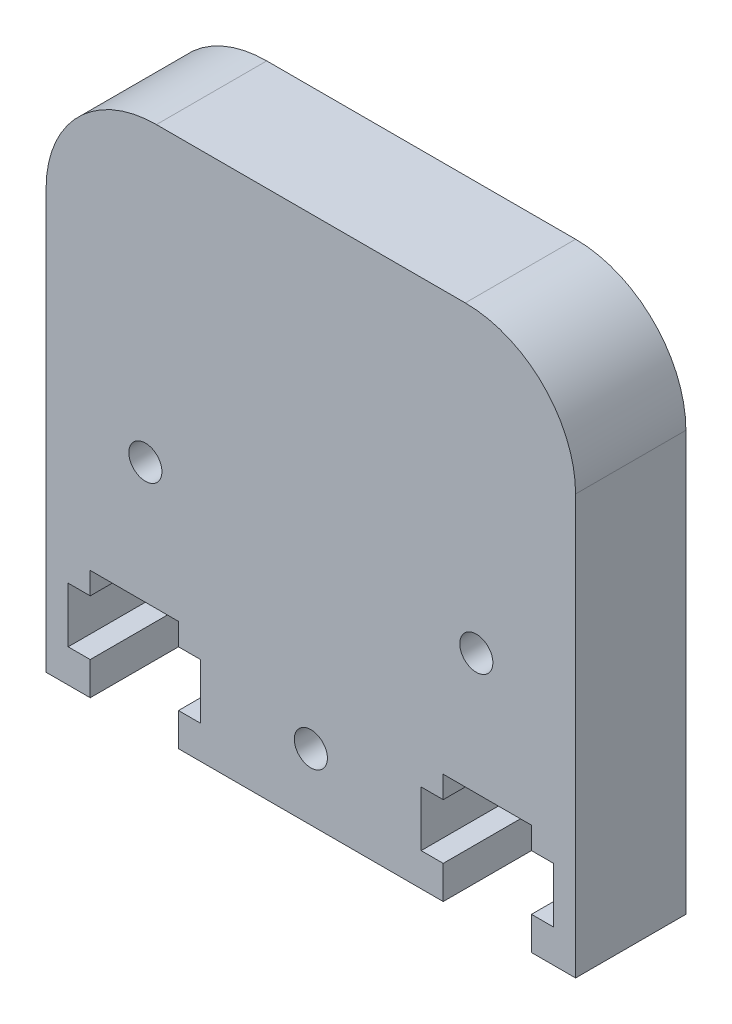
ISO-10303-21;
HEADER;
FILE_DESCRIPTION(('STEP AP214'),'2;1');
FILE_NAME('part.step','',(''),(''),'','','');
FILE_SCHEMA(('AUTOMOTIVE_DESIGN { 1 0 10303 214 1 1 1 1 }'));
ENDSEC;
DATA;
#1=APPLICATION_CONTEXT('core data for automotive mechanical design processes');
#2=APPLICATION_PROTOCOL_DEFINITION('international standard','automotive_design',2000,#1);
#3=PRODUCT_CONTEXT('',#1,'mechanical');
#4=PRODUCT('Part','Part','',(#3));
#5=PRODUCT_RELATED_PRODUCT_CATEGORY('part','',(#4));
#6=PRODUCT_DEFINITION_FORMATION('','',#4);
#7=PRODUCT_DEFINITION_CONTEXT('part definition',#1,'design');
#8=PRODUCT_DEFINITION('design','',#6,#7);
#9=PRODUCT_DEFINITION_SHAPE('','',#8);
#10=(LENGTH_UNIT() NAMED_UNIT(*) SI_UNIT(.MILLI.,.METRE.));
#11=(NAMED_UNIT(*) PLANE_ANGLE_UNIT() SI_UNIT($,.RADIAN.));
#12=(NAMED_UNIT(*) SI_UNIT($,.STERADIAN.) SOLID_ANGLE_UNIT());
#13=UNCERTAINTY_MEASURE_WITH_UNIT(LENGTH_MEASURE(1.E-05),#10,'distance_accuracy_value','');
#14=(GEOMETRIC_REPRESENTATION_CONTEXT(3) GLOBAL_UNCERTAINTY_ASSIGNED_CONTEXT((#13)) GLOBAL_UNIT_ASSIGNED_CONTEXT((#10,
#11,#12)) REPRESENTATION_CONTEXT('',''));
#15=CARTESIAN_POINT('',(0.,0.,0.));
#16=DIRECTION('',(0.,0.,1.));
#17=DIRECTION('',(1.,0.,0.));
#18=AXIS2_PLACEMENT_3D('',#15,#16,#17);
#19=CARTESIAN_POINT('',(0.,0.,5.));
#20=DIRECTION('',(0.,0.,1.));
#21=DIRECTION('',(1.,0.,0.));
#22=AXIS2_PLACEMENT_3D('',#19,#20,#21);
#23=PLANE('',#22);
#24=CARTESIAN_POINT('',(-7.5,-1.5,5.));
#25=DIRECTION('',(0.,0.,1.));
#26=DIRECTION('',(1.,0.,0.));
#27=AXIS2_PLACEMENT_3D('',#24,#25,#26);
#28=CIRCLE('',#27,0.750000000000001);
#29=CARTESIAN_POINT('',(-6.75,-1.5,5.));
#30=VERTEX_POINT('',#29);
#31=EDGE_CURVE('E415',#30,#30,#28,.T.);
#32=ORIENTED_EDGE('',*,*,#31,.F.);
#33=EDGE_LOOP('',(#32));
#34=FACE_BOUND('',#33,.T.);
#35=CARTESIAN_POINT('',(0.,-9.00000000000001,5.));
#36=DIRECTION('',(0.,0.,1.));
#37=DIRECTION('',(1.,0.,0.));
#38=AXIS2_PLACEMENT_3D('',#35,#36,#37);
#39=CIRCLE('',#38,0.750000000000001);
#40=CARTESIAN_POINT('',(0.750000000000004,-9.00000000000001,5.));
#41=VERTEX_POINT('',#40);
#42=EDGE_CURVE('E421',#41,#41,#39,.T.);
#43=ORIENTED_EDGE('',*,*,#42,.F.);
#44=EDGE_LOOP('',(#43));
#45=FACE_BOUND('',#44,.T.);
#46=CARTESIAN_POINT('',(7.5,-1.5,5.));
#47=DIRECTION('',(0.,0.,1.));
#48=DIRECTION('',(1.,0.,0.));
#49=AXIS2_PLACEMENT_3D('',#46,#47,#48);
#50=CIRCLE('',#49,0.750000000000038);
#51=CARTESIAN_POINT('',(8.25000000000004,-1.5,5.));
#52=VERTEX_POINT('',#51);
#53=EDGE_CURVE('E409',#52,#52,#50,.T.);
#54=ORIENTED_EDGE('',*,*,#53,.F.);
#55=EDGE_LOOP('',(#54));
#56=FACE_BOUND('',#55,.T.);
#57=DIRECTION('',(1.,0.,0.));
#58=VECTOR('',#57,1.);
#59=CARTESIAN_POINT('',(-12.,-12.,5.));
#60=LINE('',#59,#58);
#61=CARTESIAN_POINT('',(-6.,-12.,5.));
#62=VERTEX_POINT('',#61);
#63=CARTESIAN_POINT('',(6.,-12.,5.));
#64=VERTEX_POINT('',#63);
#65=EDGE_CURVE('E441',#62,#64,#60,.T.);
#66=ORIENTED_EDGE('',*,*,#65,.T.);
#67=DIRECTION('',(0.,1.,0.));
#68=VECTOR('',#67,1.);
#69=CARTESIAN_POINT('',(6.,-10.5,5.));
#70=LINE('',#69,#68);
#71=CARTESIAN_POINT('',(6.,-10.5,5.));
#72=VERTEX_POINT('',#71);
#73=EDGE_CURVE('E250',#64,#72,#70,.T.);
#74=ORIENTED_EDGE('',*,*,#73,.T.);
#75=DIRECTION('',(-1.,0.,0.));
#76=VECTOR('',#75,1.);
#77=CARTESIAN_POINT('',(5.,-10.5,5.));
#78=LINE('',#77,#76);
#79=CARTESIAN_POINT('',(5.,-10.5,5.));
#80=VERTEX_POINT('',#79);
#81=EDGE_CURVE('E253',#72,#80,#78,.T.);
#82=ORIENTED_EDGE('',*,*,#81,.T.);
#83=DIRECTION('',(0.,1.,0.));
#84=VECTOR('',#83,1.);
#85=CARTESIAN_POINT('',(5.,-8.,5.));
#86=LINE('',#85,#84);
#87=CARTESIAN_POINT('',(5.,-8.,5.));
#88=VERTEX_POINT('',#87);
#89=EDGE_CURVE('E294',#80,#88,#86,.T.);
#90=ORIENTED_EDGE('',*,*,#89,.T.);
#91=DIRECTION('',(1.,0.,0.));
#92=VECTOR('',#91,1.);
#93=CARTESIAN_POINT('',(6.,-8.,5.));
#94=LINE('',#93,#92);
#95=CARTESIAN_POINT('',(6.,-8.,5.));
#96=VERTEX_POINT('',#95);
#97=EDGE_CURVE('E291',#88,#96,#94,.T.);
#98=ORIENTED_EDGE('',*,*,#97,.T.);
#99=DIRECTION('',(0.,1.,0.));
#100=VECTOR('',#99,1.);
#101=CARTESIAN_POINT('',(6.,-7.,5.));
#102=LINE('',#101,#100);
#103=CARTESIAN_POINT('',(6.,-7.,5.));
#104=VERTEX_POINT('',#103);
#105=EDGE_CURVE('E288',#96,#104,#102,.T.);
#106=ORIENTED_EDGE('',*,*,#105,.T.);
#107=DIRECTION('',(1.,0.,0.));
#108=VECTOR('',#107,1.);
#109=CARTESIAN_POINT('',(10.,-7.,5.));
#110=LINE('',#109,#108);
#111=CARTESIAN_POINT('',(10.,-7.,5.));
#112=VERTEX_POINT('',#111);
#113=EDGE_CURVE('E285',#104,#112,#110,.T.);
#114=ORIENTED_EDGE('',*,*,#113,.T.);
#115=DIRECTION('',(0.,-1.,0.));
#116=VECTOR('',#115,1.);
#117=CARTESIAN_POINT('',(10.,-8.,5.));
#118=LINE('',#117,#116);
#119=CARTESIAN_POINT('',(10.,-8.,5.));
#120=VERTEX_POINT('',#119);
#121=EDGE_CURVE('E282',#112,#120,#118,.T.);
#122=ORIENTED_EDGE('',*,*,#121,.T.);
#123=DIRECTION('',(1.,0.,0.));
#124=VECTOR('',#123,1.);
#125=CARTESIAN_POINT('',(11.,-8.,5.));
#126=LINE('',#125,#124);
#127=CARTESIAN_POINT('',(11.,-8.,5.));
#128=VERTEX_POINT('',#127);
#129=EDGE_CURVE('E279',#120,#128,#126,.T.);
#130=ORIENTED_EDGE('',*,*,#129,.T.);
#131=DIRECTION('',(0.,-1.,0.));
#132=VECTOR('',#131,1.);
#133=CARTESIAN_POINT('',(11.,-10.5,5.));
#134=LINE('',#133,#132);
#135=CARTESIAN_POINT('',(11.,-10.5,5.));
#136=VERTEX_POINT('',#135);
#137=EDGE_CURVE('E276',#128,#136,#134,.T.);
#138=ORIENTED_EDGE('',*,*,#137,.T.);
#139=DIRECTION('',(-1.,0.,0.));
#140=VECTOR('',#139,1.);
#141=CARTESIAN_POINT('',(10.,-10.5,5.));
#142=LINE('',#141,#140);
#143=CARTESIAN_POINT('',(10.,-10.5,5.));
#144=VERTEX_POINT('',#143);
#145=EDGE_CURVE('E274',#136,#144,#142,.T.);
#146=ORIENTED_EDGE('',*,*,#145,.T.);
#147=DIRECTION('',(0.,-1.,0.));
#148=VECTOR('',#147,1.);
#149=CARTESIAN_POINT('',(10.,-12.,5.));
#150=LINE('',#149,#148);
#151=CARTESIAN_POINT('',(10.,-12.,5.));
#152=VERTEX_POINT('',#151);
#153=EDGE_CURVE('E241',#144,#152,#150,.T.);
#154=ORIENTED_EDGE('',*,*,#153,.T.);
#155=CARTESIAN_POINT('',(12.,-12.,5.));
#156=VERTEX_POINT('',#155);
#157=EDGE_CURVE('E436',#152,#156,#60,.T.);
#158=ORIENTED_EDGE('',*,*,#157,.T.);
#159=DIRECTION('',(0.,1.,0.));
#160=VECTOR('',#159,1.);
#161=CARTESIAN_POINT('',(12.,12.,5.));
#162=LINE('',#161,#160);
#163=CARTESIAN_POINT('',(12.,7.,5.));
#164=VERTEX_POINT('',#163);
#165=EDGE_CURVE('E427',#156,#164,#162,.T.);
#166=ORIENTED_EDGE('',*,*,#165,.T.);
#167=CARTESIAN_POINT('',(7.,7.,5.));
#168=DIRECTION('',(0.,0.,1.));
#169=DIRECTION('',(1.,0.,0.));
#170=AXIS2_PLACEMENT_3D('',#167,#168,#169);
#171=CIRCLE('',#170,5.);
#172=CARTESIAN_POINT('',(7.,12.,5.));
#173=VERTEX_POINT('',#172);
#174=EDGE_CURVE('E469',#164,#173,#171,.T.);
#175=ORIENTED_EDGE('',*,*,#174,.T.);
#176=DIRECTION('',(-1.,0.,0.));
#177=VECTOR('',#176,1.);
#178=CARTESIAN_POINT('',(-12.,12.,5.));
#179=LINE('',#178,#177);
#180=CARTESIAN_POINT('',(-7.,12.,5.));
#181=VERTEX_POINT('',#180);
#182=EDGE_CURVE('E430',#173,#181,#179,.T.);
#183=ORIENTED_EDGE('',*,*,#182,.T.);
#184=CARTESIAN_POINT('',(-7.,7.,5.));
#185=DIRECTION('',(0.,0.,1.));
#186=DIRECTION('',(1.,0.,0.));
#187=AXIS2_PLACEMENT_3D('',#184,#185,#186);
#188=CIRCLE('',#187,5.);
#189=CARTESIAN_POINT('',(-12.,7.,5.));
#190=VERTEX_POINT('',#189);
#191=EDGE_CURVE('E40',#181,#190,#188,.T.);
#192=ORIENTED_EDGE('',*,*,#191,.T.);
#193=DIRECTION('',(0.,-1.,0.));
#194=VECTOR('',#193,1.);
#195=CARTESIAN_POINT('',(-12.,12.,5.));
#196=LINE('',#195,#194);
#197=CARTESIAN_POINT('',(-12.,-12.,5.));
#198=VERTEX_POINT('',#197);
#199=EDGE_CURVE('E434',#190,#198,#196,.T.);
#200=ORIENTED_EDGE('',*,*,#199,.T.);
#201=CARTESIAN_POINT('',(-10.,-12.,5.));
#202=VERTEX_POINT('',#201);
#203=EDGE_CURVE('E437',#198,#202,#60,.T.);
#204=ORIENTED_EDGE('',*,*,#203,.T.);
#205=DIRECTION('',(0.,-1.,0.));
#206=VECTOR('',#205,1.);
#207=CARTESIAN_POINT('',(-10.,-12.,5.));
#208=LINE('',#207,#206);
#209=CARTESIAN_POINT('',(-10.,-10.5,5.));
#210=VERTEX_POINT('',#209);
#211=EDGE_CURVE('E323',#210,#202,#208,.T.);
#212=ORIENTED_EDGE('',*,*,#211,.F.);
#213=DIRECTION('',(1.,0.,0.));
#214=VECTOR('',#213,1.);
#215=CARTESIAN_POINT('',(-10.,-10.5,5.));
#216=LINE('',#215,#214);
#217=CARTESIAN_POINT('',(-11.,-10.5,5.));
#218=VERTEX_POINT('',#217);
#219=EDGE_CURVE('E380',#218,#210,#216,.T.);
#220=ORIENTED_EDGE('',*,*,#219,.F.);
#221=DIRECTION('',(0.,-1.,0.));
#222=VECTOR('',#221,1.);
#223=CARTESIAN_POINT('',(-11.,-10.5,5.));
#224=LINE('',#223,#222);
#225=CARTESIAN_POINT('',(-11.,-8.,5.));
#226=VERTEX_POINT('',#225);
#227=EDGE_CURVE('E377',#226,#218,#224,.T.);
#228=ORIENTED_EDGE('',*,*,#227,.F.);
#229=DIRECTION('',(-1.,0.,0.));
#230=VECTOR('',#229,1.);
#231=CARTESIAN_POINT('',(-11.,-8.,5.));
#232=LINE('',#231,#230);
#233=CARTESIAN_POINT('',(-10.,-8.,5.));
#234=VERTEX_POINT('',#233);
#235=EDGE_CURVE('E374',#234,#226,#232,.T.);
#236=ORIENTED_EDGE('',*,*,#235,.F.);
#237=DIRECTION('',(0.,-1.,0.));
#238=VECTOR('',#237,1.);
#239=CARTESIAN_POINT('',(-10.,-8.,5.));
#240=LINE('',#239,#238);
#241=CARTESIAN_POINT('',(-10.,-7.,5.));
#242=VERTEX_POINT('',#241);
#243=EDGE_CURVE('E371',#242,#234,#240,.T.);
#244=ORIENTED_EDGE('',*,*,#243,.F.);
#245=DIRECTION('',(-1.,0.,0.));
#246=VECTOR('',#245,1.);
#247=CARTESIAN_POINT('',(-10.,-7.,5.));
#248=LINE('',#247,#246);
#249=CARTESIAN_POINT('',(-6.,-7.,5.));
#250=VERTEX_POINT('',#249);
#251=EDGE_CURVE('E368',#250,#242,#248,.T.);
#252=ORIENTED_EDGE('',*,*,#251,.F.);
#253=DIRECTION('',(0.,1.,0.));
#254=VECTOR('',#253,1.);
#255=CARTESIAN_POINT('',(-6.,-7.,5.));
#256=LINE('',#255,#254);
#257=CARTESIAN_POINT('',(-6.,-8.,5.));
#258=VERTEX_POINT('',#257);
#259=EDGE_CURVE('E365',#258,#250,#256,.T.);
#260=ORIENTED_EDGE('',*,*,#259,.F.);
#261=DIRECTION('',(-1.,0.,0.));
#262=VECTOR('',#261,1.);
#263=CARTESIAN_POINT('',(-6.,-8.,5.));
#264=LINE('',#263,#262);
#265=CARTESIAN_POINT('',(-5.,-8.,5.));
#266=VERTEX_POINT('',#265);
#267=EDGE_CURVE('E362',#266,#258,#264,.T.);
#268=ORIENTED_EDGE('',*,*,#267,.F.);
#269=DIRECTION('',(0.,1.,0.));
#270=VECTOR('',#269,1.);
#271=CARTESIAN_POINT('',(-5.,-8.,5.));
#272=LINE('',#271,#270);
#273=CARTESIAN_POINT('',(-5.,-10.5,5.));
#274=VERTEX_POINT('',#273);
#275=EDGE_CURVE('E359',#274,#266,#272,.T.);
#276=ORIENTED_EDGE('',*,*,#275,.F.);
#277=DIRECTION('',(1.,0.,0.));
#278=VECTOR('',#277,1.);
#279=CARTESIAN_POINT('',(-5.,-10.5,5.));
#280=LINE('',#279,#278);
#281=CARTESIAN_POINT('',(-6.,-10.5,5.));
#282=VERTEX_POINT('',#281);
#283=EDGE_CURVE('E356',#282,#274,#280,.T.);
#284=ORIENTED_EDGE('',*,*,#283,.F.);
#285=DIRECTION('',(0.,1.,0.));
#286=VECTOR('',#285,1.);
#287=CARTESIAN_POINT('',(-6.,-10.5,5.));
#288=LINE('',#287,#286);
#289=EDGE_CURVE('E302',#62,#282,#288,.T.);
#290=ORIENTED_EDGE('',*,*,#289,.F.);
#291=EDGE_LOOP('',(#66,#74,#82,#90,#98,#106,#114,#122,#130,#138,#146,#154,#158,#166,#175,#183,
#192,#200,#204,#212,#220,#228,#236,#244,#252,#260,#268,#276,#284,#290));
#292=FACE_BOUND('',#291,.T.);
#293=ADVANCED_FACE('F32',(#34,#45,#56,#292),#23,.T.);
#294=CARTESIAN_POINT('',(0.,0.,0.));
#295=DIRECTION('',(0.,0.,1.));
#296=DIRECTION('',(1.,0.,0.));
#297=AXIS2_PLACEMENT_3D('',#294,#295,#296);
#298=PLANE('',#297);
#299=CARTESIAN_POINT('',(7.5,-1.5,0.));
#300=DIRECTION('',(0.,0.,1.));
#301=DIRECTION('',(1.,0.,0.));
#302=AXIS2_PLACEMENT_3D('',#299,#300,#301);
#303=CIRCLE('',#302,0.750000000000038);
#304=CARTESIAN_POINT('',(8.25000000000004,-1.5,0.));
#305=VERTEX_POINT('',#304);
#306=EDGE_CURVE('E387',#305,#305,#303,.T.);
#307=ORIENTED_EDGE('',*,*,#306,.T.);
#308=EDGE_LOOP('',(#307));
#309=FACE_BOUND('',#308,.T.);
#310=CARTESIAN_POINT('',(-7.5,-1.5,0.));
#311=DIRECTION('',(0.,0.,1.));
#312=DIRECTION('',(1.,0.,0.));
#313=AXIS2_PLACEMENT_3D('',#310,#311,#312);
#314=CIRCLE('',#313,0.750000000000001);
#315=CARTESIAN_POINT('',(-6.75,-1.5,0.));
#316=VERTEX_POINT('',#315);
#317=EDGE_CURVE('E412',#316,#316,#314,.T.);
#318=ORIENTED_EDGE('',*,*,#317,.T.);
#319=EDGE_LOOP('',(#318));
#320=FACE_BOUND('',#319,.T.);
#321=CARTESIAN_POINT('',(0.,-9.00000000000001,0.));
#322=DIRECTION('',(0.,0.,1.));
#323=DIRECTION('',(1.,0.,0.));
#324=AXIS2_PLACEMENT_3D('',#321,#322,#323);
#325=CIRCLE('',#324,0.750000000000001);
#326=CARTESIAN_POINT('',(0.750000000000004,-9.00000000000001,0.));
#327=VERTEX_POINT('',#326);
#328=EDGE_CURVE('E418',#327,#327,#325,.T.);
#329=ORIENTED_EDGE('',*,*,#328,.T.);
#330=EDGE_LOOP('',(#329));
#331=FACE_BOUND('',#330,.T.);
#332=DIRECTION('',(0.,1.,0.));
#333=VECTOR('',#332,1.);
#334=CARTESIAN_POINT('',(6.,-10.5,0.));
#335=LINE('',#334,#333);
#336=CARTESIAN_POINT('',(6.,-12.,0.));
#337=VERTEX_POINT('',#336);
#338=CARTESIAN_POINT('',(6.,-10.5,0.));
#339=VERTEX_POINT('',#338);
#340=EDGE_CURVE('E271',#337,#339,#335,.T.);
#341=ORIENTED_EDGE('',*,*,#340,.F.);
#342=DIRECTION('',(1.,0.,0.));
#343=VECTOR('',#342,1.);
#344=CARTESIAN_POINT('',(-12.,-12.,0.));
#345=LINE('',#344,#343);
#346=CARTESIAN_POINT('',(-6.,-12.,0.));
#347=VERTEX_POINT('',#346);
#348=EDGE_CURVE('E451',#347,#337,#345,.T.);
#349=ORIENTED_EDGE('',*,*,#348,.F.);
#350=DIRECTION('',(0.,1.,0.));
#351=VECTOR('',#350,1.);
#352=CARTESIAN_POINT('',(-6.,-10.5,0.));
#353=LINE('',#352,#351);
#354=CARTESIAN_POINT('',(-6.,-10.5,0.));
#355=VERTEX_POINT('',#354);
#356=EDGE_CURVE('E55',#347,#355,#353,.T.);
#357=ORIENTED_EDGE('',*,*,#356,.T.);
#358=DIRECTION('',(1.,0.,0.));
#359=VECTOR('',#358,1.);
#360=CARTESIAN_POINT('',(-5.,-10.5,0.));
#361=LINE('',#360,#359);
#362=CARTESIAN_POINT('',(-5.,-10.5,0.));
#363=VERTEX_POINT('',#362);
#364=EDGE_CURVE('E322',#355,#363,#361,.T.);
#365=ORIENTED_EDGE('',*,*,#364,.T.);
#366=DIRECTION('',(0.,1.,0.));
#367=VECTOR('',#366,1.);
#368=CARTESIAN_POINT('',(-5.,-8.,0.));
#369=LINE('',#368,#367);
#370=CARTESIAN_POINT('',(-5.,-8.,0.));
#371=VERTEX_POINT('',#370);
#372=EDGE_CURVE('E326',#363,#371,#369,.T.);
#373=ORIENTED_EDGE('',*,*,#372,.T.);
#374=DIRECTION('',(-1.,0.,0.));
#375=VECTOR('',#374,1.);
#376=CARTESIAN_POINT('',(-6.,-8.,0.));
#377=LINE('',#376,#375);
#378=CARTESIAN_POINT('',(-6.,-8.,0.));
#379=VERTEX_POINT('',#378);
#380=EDGE_CURVE('E329',#371,#379,#377,.T.);
#381=ORIENTED_EDGE('',*,*,#380,.T.);
#382=DIRECTION('',(0.,1.,0.));
#383=VECTOR('',#382,1.);
#384=CARTESIAN_POINT('',(-6.,-7.,0.));
#385=LINE('',#384,#383);
#386=CARTESIAN_POINT('',(-6.,-7.,0.));
#387=VERTEX_POINT('',#386);
#388=EDGE_CURVE('E332',#379,#387,#385,.T.);
#389=ORIENTED_EDGE('',*,*,#388,.T.);
#390=DIRECTION('',(-1.,0.,0.));
#391=VECTOR('',#390,1.);
#392=CARTESIAN_POINT('',(-10.,-7.,0.));
#393=LINE('',#392,#391);
#394=CARTESIAN_POINT('',(-10.,-7.,0.));
#395=VERTEX_POINT('',#394);
#396=EDGE_CURVE('E335',#387,#395,#393,.T.);
#397=ORIENTED_EDGE('',*,*,#396,.T.);
#398=DIRECTION('',(0.,-1.,0.));
#399=VECTOR('',#398,1.);
#400=CARTESIAN_POINT('',(-10.,-8.,0.));
#401=LINE('',#400,#399);
#402=CARTESIAN_POINT('',(-10.,-8.,0.));
#403=VERTEX_POINT('',#402);
#404=EDGE_CURVE('E338',#395,#403,#401,.T.);
#405=ORIENTED_EDGE('',*,*,#404,.T.);
#406=DIRECTION('',(-1.,0.,0.));
#407=VECTOR('',#406,1.);
#408=CARTESIAN_POINT('',(-11.,-8.,0.));
#409=LINE('',#408,#407);
#410=CARTESIAN_POINT('',(-11.,-8.,0.));
#411=VERTEX_POINT('',#410);
#412=EDGE_CURVE('E341',#403,#411,#409,.T.);
#413=ORIENTED_EDGE('',*,*,#412,.T.);
#414=DIRECTION('',(0.,-1.,0.));
#415=VECTOR('',#414,1.);
#416=CARTESIAN_POINT('',(-11.,-10.5,0.));
#417=LINE('',#416,#415);
#418=CARTESIAN_POINT('',(-11.,-10.5,0.));
#419=VERTEX_POINT('',#418);
#420=EDGE_CURVE('E344',#411,#419,#417,.T.);
#421=ORIENTED_EDGE('',*,*,#420,.T.);
#422=DIRECTION('',(1.,0.,0.));
#423=VECTOR('',#422,1.);
#424=CARTESIAN_POINT('',(-10.,-10.5,0.));
#425=LINE('',#424,#423);
#426=CARTESIAN_POINT('',(-10.,-10.5,0.));
#427=VERTEX_POINT('',#426);
#428=EDGE_CURVE('E347',#419,#427,#425,.T.);
#429=ORIENTED_EDGE('',*,*,#428,.T.);
#430=DIRECTION('',(0.,-1.,0.));
#431=VECTOR('',#430,1.);
#432=CARTESIAN_POINT('',(-10.,-12.,0.));
#433=LINE('',#432,#431);
#434=CARTESIAN_POINT('',(-10.,-12.,0.));
#435=VERTEX_POINT('',#434);
#436=EDGE_CURVE('E350',#427,#435,#433,.T.);
#437=ORIENTED_EDGE('',*,*,#436,.T.);
#438=CARTESIAN_POINT('',(-12.,-12.,0.));
#439=VERTEX_POINT('',#438);
#440=EDGE_CURVE('E431',#439,#435,#345,.T.);
#441=ORIENTED_EDGE('',*,*,#440,.F.);
#442=DIRECTION('',(0.,-1.,0.));
#443=VECTOR('',#442,1.);
#444=CARTESIAN_POINT('',(-12.,12.,0.));
#445=LINE('',#444,#443);
#446=CARTESIAN_POINT('',(-12.,7.,0.));
#447=VERTEX_POINT('',#446);
#448=EDGE_CURVE('E447',#447,#439,#445,.T.);
#449=ORIENTED_EDGE('',*,*,#448,.F.);
#450=CARTESIAN_POINT('',(-7.,7.,0.));
#451=DIRECTION('',(0.,0.,1.));
#452=DIRECTION('',(1.,0.,0.));
#453=AXIS2_PLACEMENT_3D('',#450,#451,#452);
#454=CIRCLE('',#453,5.);
#455=CARTESIAN_POINT('',(-7.,12.,0.));
#456=VERTEX_POINT('',#455);
#457=EDGE_CURVE('E462',#447,#456,#454,.F.);
#458=ORIENTED_EDGE('',*,*,#457,.T.);
#459=DIRECTION('',(-1.,0.,0.));
#460=VECTOR('',#459,1.);
#461=CARTESIAN_POINT('',(-12.,12.,0.));
#462=LINE('',#461,#460);
#463=CARTESIAN_POINT('',(7.,12.,0.));
#464=VERTEX_POINT('',#463);
#465=EDGE_CURVE('E444',#464,#456,#462,.T.);
#466=ORIENTED_EDGE('',*,*,#465,.F.);
#467=CARTESIAN_POINT('',(7.,7.,0.));
#468=DIRECTION('',(0.,0.,1.));
#469=DIRECTION('',(1.,0.,0.));
#470=AXIS2_PLACEMENT_3D('',#467,#468,#469);
#471=CIRCLE('',#470,5.);
#472=CARTESIAN_POINT('',(12.,7.,0.));
#473=VERTEX_POINT('',#472);
#474=EDGE_CURVE('E460',#464,#473,#471,.F.);
#475=ORIENTED_EDGE('',*,*,#474,.T.);
#476=DIRECTION('',(0.,1.,0.));
#477=VECTOR('',#476,1.);
#478=CARTESIAN_POINT('',(12.,12.,0.));
#479=LINE('',#478,#477);
#480=CARTESIAN_POINT('',(12.,-12.,0.));
#481=VERTEX_POINT('',#480);
#482=EDGE_CURVE('E424',#481,#473,#479,.T.);
#483=ORIENTED_EDGE('',*,*,#482,.F.);
#484=CARTESIAN_POINT('',(10.,-12.,0.));
#485=VERTEX_POINT('',#484);
#486=EDGE_CURVE('E249',#485,#481,#345,.T.);
#487=ORIENTED_EDGE('',*,*,#486,.F.);
#488=DIRECTION('',(0.,-1.,0.));
#489=VECTOR('',#488,1.);
#490=CARTESIAN_POINT('',(10.,-12.,0.));
#491=LINE('',#490,#489);
#492=CARTESIAN_POINT('',(10.,-10.5,0.));
#493=VERTEX_POINT('',#492);
#494=EDGE_CURVE('E47',#493,#485,#491,.T.);
#495=ORIENTED_EDGE('',*,*,#494,.F.);
#496=DIRECTION('',(-1.,0.,0.));
#497=VECTOR('',#496,1.);
#498=CARTESIAN_POINT('',(10.,-10.5,0.));
#499=LINE('',#498,#497);
#500=CARTESIAN_POINT('',(11.,-10.5,0.));
#501=VERTEX_POINT('',#500);
#502=EDGE_CURVE('E229',#501,#493,#499,.T.);
#503=ORIENTED_EDGE('',*,*,#502,.F.);
#504=DIRECTION('',(0.,-1.,0.));
#505=VECTOR('',#504,1.);
#506=CARTESIAN_POINT('',(11.,-10.5,0.));
#507=LINE('',#506,#505);
#508=CARTESIAN_POINT('',(11.,-8.,0.));
#509=VERTEX_POINT('',#508);
#510=EDGE_CURVE('E237',#509,#501,#507,.T.);
#511=ORIENTED_EDGE('',*,*,#510,.F.);
#512=DIRECTION('',(1.,0.,0.));
#513=VECTOR('',#512,1.);
#514=CARTESIAN_POINT('',(11.,-8.,0.));
#515=LINE('',#514,#513);
#516=CARTESIAN_POINT('',(10.,-8.,0.));
#517=VERTEX_POINT('',#516);
#518=EDGE_CURVE('E257',#517,#509,#515,.T.);
#519=ORIENTED_EDGE('',*,*,#518,.F.);
#520=DIRECTION('',(0.,-1.,0.));
#521=VECTOR('',#520,1.);
#522=CARTESIAN_POINT('',(10.,-8.,0.));
#523=LINE('',#522,#521);
#524=CARTESIAN_POINT('',(10.,-7.,0.));
#525=VERTEX_POINT('',#524);
#526=EDGE_CURVE('E259',#525,#517,#523,.T.);
#527=ORIENTED_EDGE('',*,*,#526,.F.);
#528=DIRECTION('',(1.,0.,0.));
#529=VECTOR('',#528,1.);
#530=CARTESIAN_POINT('',(10.,-7.,0.));
#531=LINE('',#530,#529);
#532=CARTESIAN_POINT('',(6.,-7.,0.));
#533=VERTEX_POINT('',#532);
#534=EDGE_CURVE('E261',#533,#525,#531,.T.);
#535=ORIENTED_EDGE('',*,*,#534,.F.);
#536=DIRECTION('',(0.,1.,0.));
#537=VECTOR('',#536,1.);
#538=CARTESIAN_POINT('',(6.,-7.,0.));
#539=LINE('',#538,#537);
#540=CARTESIAN_POINT('',(6.,-8.,0.));
#541=VERTEX_POINT('',#540);
#542=EDGE_CURVE('E263',#541,#533,#539,.T.);
#543=ORIENTED_EDGE('',*,*,#542,.F.);
#544=DIRECTION('',(1.,0.,0.));
#545=VECTOR('',#544,1.);
#546=CARTESIAN_POINT('',(6.,-8.,0.));
#547=LINE('',#546,#545);
#548=CARTESIAN_POINT('',(5.,-8.,0.));
#549=VERTEX_POINT('',#548);
#550=EDGE_CURVE('E265',#549,#541,#547,.T.);
#551=ORIENTED_EDGE('',*,*,#550,.F.);
#552=DIRECTION('',(0.,1.,0.));
#553=VECTOR('',#552,1.);
#554=CARTESIAN_POINT('',(5.,-8.,0.));
#555=LINE('',#554,#553);
#556=CARTESIAN_POINT('',(5.,-10.5,0.));
#557=VERTEX_POINT('',#556);
#558=EDGE_CURVE('E267',#557,#549,#555,.T.);
#559=ORIENTED_EDGE('',*,*,#558,.F.);
#560=DIRECTION('',(-1.,0.,0.));
#561=VECTOR('',#560,1.);
#562=CARTESIAN_POINT('',(5.,-10.5,0.));
#563=LINE('',#562,#561);
#564=EDGE_CURVE('E269',#339,#557,#563,.T.);
#565=ORIENTED_EDGE('',*,*,#564,.F.);
#566=EDGE_LOOP('',(#341,#349,#357,#365,#373,#381,#389,#397,#405,#413,#421,#429,#437,#441,#449,
#458,#466,#475,#483,#487,#495,#503,#511,#519,#527,#535,#543,#551,#559,#565));
#567=FACE_BOUND('',#566,.T.);
#568=ADVANCED_FACE('F247',(#309,#320,#331,#567),#298,.F.);
#569=CARTESIAN_POINT('',(-12.,-12.,5.));
#570=DIRECTION('',(0.,1.,0.));
#571=DIRECTION('',(-1.,0.,0.));
#572=AXIS2_PLACEMENT_3D('',#569,#570,#571);
#573=PLANE('',#572);
#574=DIRECTION('',(0.,0.,1.));
#575=VECTOR('',#574,1.);
#576=CARTESIAN_POINT('',(6.,-12.,0.));
#577=LINE('',#576,#575);
#578=EDGE_CURVE('E299',#337,#64,#577,.T.);
#579=ORIENTED_EDGE('',*,*,#578,.T.);
#580=ORIENTED_EDGE('',*,*,#65,.F.);
#581=DIRECTION('',(0.,0.,1.));
#582=VECTOR('',#581,1.);
#583=CARTESIAN_POINT('',(-6.,-12.,0.));
#584=LINE('',#583,#582);
#585=EDGE_CURVE('E353',#347,#62,#584,.T.);
#586=ORIENTED_EDGE('',*,*,#585,.F.);
#587=ORIENTED_EDGE('',*,*,#348,.T.);
#588=EDGE_LOOP('',(#579,#580,#586,#587));
#589=FACE_BOUND('',#588,.T.);
#590=ADVANCED_FACE('F502',(#589),#573,.F.);
#591=DIRECTION('',(0.,0.,1.));
#592=VECTOR('',#591,1.);
#593=CARTESIAN_POINT('',(10.,-12.,0.));
#594=LINE('',#593,#592);
#595=EDGE_CURVE('E243',#485,#152,#594,.T.);
#596=ORIENTED_EDGE('',*,*,#595,.F.);
#597=ORIENTED_EDGE('',*,*,#486,.T.);
#598=DIRECTION('',(0.,0.,-1.));
#599=VECTOR('',#598,1.);
#600=CARTESIAN_POINT('',(12.,-12.,5.));
#601=LINE('',#600,#599);
#602=EDGE_CURVE('E440',#156,#481,#601,.T.);
#603=ORIENTED_EDGE('',*,*,#602,.F.);
#604=ORIENTED_EDGE('',*,*,#157,.F.);
#605=EDGE_LOOP('',(#596,#597,#603,#604));
#606=FACE_BOUND('',#605,.T.);
#607=ADVANCED_FACE('F498',(#606),#573,.F.);
#608=ORIENTED_EDGE('',*,*,#440,.T.);
#609=DIRECTION('',(0.,0.,1.));
#610=VECTOR('',#609,1.);
#611=CARTESIAN_POINT('',(-10.,-12.,0.));
#612=LINE('',#611,#610);
#613=EDGE_CURVE('E384',#435,#202,#612,.T.);
#614=ORIENTED_EDGE('',*,*,#613,.T.);
#615=ORIENTED_EDGE('',*,*,#203,.F.);
#616=DIRECTION('',(0.,0.,-1.));
#617=VECTOR('',#616,1.);
#618=CARTESIAN_POINT('',(-12.,-12.,5.));
#619=LINE('',#618,#617);
#620=EDGE_CURVE('E454',#198,#439,#619,.T.);
#621=ORIENTED_EDGE('',*,*,#620,.T.);
#622=EDGE_LOOP('',(#608,#614,#615,#621));
#623=FACE_BOUND('',#622,.T.);
#624=ADVANCED_FACE('F571',(#623),#573,.F.);
#625=CARTESIAN_POINT('',(12.,12.,5.));
#626=DIRECTION('',(-1.,0.,0.));
#627=DIRECTION('',(0.,-1.,0.));
#628=AXIS2_PLACEMENT_3D('',#625,#626,#627);
#629=PLANE('',#628);
#630=ORIENTED_EDGE('',*,*,#482,.T.);
#631=DIRECTION('',(0.,0.,-1.));
#632=VECTOR('',#631,1.);
#633=CARTESIAN_POINT('',(12.,7.,5.));
#634=LINE('',#633,#632);
#635=EDGE_CURVE('E11',#473,#164,#634,.F.);
#636=ORIENTED_EDGE('',*,*,#635,.T.);
#637=ORIENTED_EDGE('',*,*,#165,.F.);
#638=ORIENTED_EDGE('',*,*,#602,.T.);
#639=EDGE_LOOP('',(#630,#636,#637,#638));
#640=FACE_BOUND('',#639,.T.);
#641=ADVANCED_FACE('F493',(#640),#629,.F.);
#642=CARTESIAN_POINT('',(-12.,12.,5.));
#643=DIRECTION('',(0.,-1.,0.));
#644=DIRECTION('',(0.,0.,-1.));
#645=AXIS2_PLACEMENT_3D('',#642,#643,#644);
#646=PLANE('',#645);
#647=ORIENTED_EDGE('',*,*,#465,.T.);
#648=DIRECTION('',(0.,0.,-1.));
#649=VECTOR('',#648,1.);
#650=CARTESIAN_POINT('',(-7.,12.,5.));
#651=LINE('',#650,#649);
#652=EDGE_CURVE('E467',#456,#181,#651,.F.);
#653=ORIENTED_EDGE('',*,*,#652,.T.);
#654=ORIENTED_EDGE('',*,*,#182,.F.);
#655=DIRECTION('',(0.,0.,-1.));
#656=VECTOR('',#655,1.);
#657=CARTESIAN_POINT('',(7.,12.,5.));
#658=LINE('',#657,#656);
#659=EDGE_CURVE('E464',#173,#464,#658,.T.);
#660=ORIENTED_EDGE('',*,*,#659,.T.);
#661=EDGE_LOOP('',(#647,#653,#654,#660));
#662=FACE_BOUND('',#661,.T.);
#663=ADVANCED_FACE('F487',(#662),#646,.F.);
#664=CARTESIAN_POINT('',(-12.,12.,5.));
#665=DIRECTION('',(1.,0.,0.));
#666=DIRECTION('',(0.,1.,0.));
#667=AXIS2_PLACEMENT_3D('',#664,#665,#666);
#668=PLANE('',#667);
#669=ORIENTED_EDGE('',*,*,#199,.F.);
#670=DIRECTION('',(0.,0.,-1.));
#671=VECTOR('',#670,1.);
#672=CARTESIAN_POINT('',(-12.,7.,5.));
#673=LINE('',#672,#671);
#674=EDGE_CURVE('E457',#190,#447,#673,.T.);
#675=ORIENTED_EDGE('',*,*,#674,.T.);
#676=ORIENTED_EDGE('',*,*,#448,.T.);
#677=ORIENTED_EDGE('',*,*,#620,.F.);
#678=EDGE_LOOP('',(#669,#675,#676,#677));
#679=FACE_BOUND('',#678,.T.);
#680=ADVANCED_FACE('F480',(#679),#668,.F.);
#681=CARTESIAN_POINT('',(0.,-9.00000000000001,5.));
#682=DIRECTION('',(0.,0.,-1.));
#683=DIRECTION('',(-1.,0.,0.));
#684=AXIS2_PLACEMENT_3D('',#681,#682,#683);
#685=CYLINDRICAL_SURFACE('',#684,0.750000000000001);
#686=ORIENTED_EDGE('',*,*,#42,.T.);
#687=EDGE_LOOP('',(#686));
#688=FACE_BOUND('',#687,.T.);
#689=ORIENTED_EDGE('',*,*,#328,.F.);
#690=EDGE_LOOP('',(#689));
#691=FACE_BOUND('',#690,.T.);
#692=ADVANCED_FACE('F566',(#688,#691),#685,.F.);
#693=CARTESIAN_POINT('',(-7.5,-1.5,5.));
#694=DIRECTION('',(0.,0.,-1.));
#695=DIRECTION('',(-1.,0.,0.));
#696=AXIS2_PLACEMENT_3D('',#693,#694,#695);
#697=CYLINDRICAL_SURFACE('',#696,0.750000000000001);
#698=ORIENTED_EDGE('',*,*,#31,.T.);
#699=EDGE_LOOP('',(#698));
#700=FACE_BOUND('',#699,.T.);
#701=ORIENTED_EDGE('',*,*,#317,.F.);
#702=EDGE_LOOP('',(#701));
#703=FACE_BOUND('',#702,.T.);
#704=ADVANCED_FACE('F584',(#700,#703),#697,.F.);
#705=CARTESIAN_POINT('',(7.5,-1.5,5.));
#706=DIRECTION('',(0.,0.,-1.));
#707=DIRECTION('',(-1.,0.,0.));
#708=AXIS2_PLACEMENT_3D('',#705,#706,#707);
#709=CYLINDRICAL_SURFACE('',#708,0.750000000000038);
#710=ORIENTED_EDGE('',*,*,#53,.T.);
#711=EDGE_LOOP('',(#710));
#712=FACE_BOUND('',#711,.T.);
#713=ORIENTED_EDGE('',*,*,#306,.F.);
#714=EDGE_LOOP('',(#713));
#715=FACE_BOUND('',#714,.T.);
#716=ADVANCED_FACE('F578',(#712,#715),#709,.F.);
#717=CARTESIAN_POINT('',(-7.,7.,5.));
#718=DIRECTION('',(0.,0.,-1.));
#719=DIRECTION('',(-1.,0.,0.));
#720=AXIS2_PLACEMENT_3D('',#717,#718,#719);
#721=CYLINDRICAL_SURFACE('',#720,5.);
#722=ORIENTED_EDGE('',*,*,#191,.F.);
#723=ORIENTED_EDGE('',*,*,#652,.F.);
#724=ORIENTED_EDGE('',*,*,#457,.F.);
#725=ORIENTED_EDGE('',*,*,#674,.F.);
#726=EDGE_LOOP('',(#722,#723,#724,#725));
#727=FACE_BOUND('',#726,.T.);
#728=ADVANCED_FACE('F483',(#727),#721,.T.);
#729=CARTESIAN_POINT('',(7.,7.,5.));
#730=DIRECTION('',(0.,0.,-1.));
#731=DIRECTION('',(-1.,0.,0.));
#732=AXIS2_PLACEMENT_3D('',#729,#730,#731);
#733=CYLINDRICAL_SURFACE('',#732,5.);
#734=ORIENTED_EDGE('',*,*,#174,.F.);
#735=ORIENTED_EDGE('',*,*,#635,.F.);
#736=ORIENTED_EDGE('',*,*,#474,.F.);
#737=ORIENTED_EDGE('',*,*,#659,.F.);
#738=EDGE_LOOP('',(#734,#735,#736,#737));
#739=FACE_BOUND('',#738,.T.);
#740=ADVANCED_FACE('F34',(#739),#733,.T.);
#741=CARTESIAN_POINT('',(-10.,-12.,0.));
#742=DIRECTION('',(-1.,0.,0.));
#743=DIRECTION('',(0.,0.,1.));
#744=AXIS2_PLACEMENT_3D('',#741,#742,#743);
#745=PLANE('',#744);
#746=ORIENTED_EDGE('',*,*,#211,.T.);
#747=ORIENTED_EDGE('',*,*,#613,.F.);
#748=ORIENTED_EDGE('',*,*,#436,.F.);
#749=DIRECTION('',(0.,0.,1.));
#750=VECTOR('',#749,1.);
#751=CARTESIAN_POINT('',(-10.,-10.5,0.));
#752=LINE('',#751,#750);
#753=EDGE_CURVE('E388',#427,#210,#752,.T.);
#754=ORIENTED_EDGE('',*,*,#753,.T.);
#755=EDGE_LOOP('',(#746,#747,#748,#754));
#756=FACE_BOUND('',#755,.T.);
#757=ADVANCED_FACE('F583',(#756),#745,.F.);
#758=CARTESIAN_POINT('',(-10.,-10.5,0.));
#759=DIRECTION('',(0.,-1.,0.));
#760=DIRECTION('',(1.,0.,0.));
#761=AXIS2_PLACEMENT_3D('',#758,#759,#760);
#762=PLANE('',#761);
#763=ORIENTED_EDGE('',*,*,#219,.T.);
#764=ORIENTED_EDGE('',*,*,#753,.F.);
#765=ORIENTED_EDGE('',*,*,#428,.F.);
#766=DIRECTION('',(0.,0.,1.));
#767=VECTOR('',#766,1.);
#768=CARTESIAN_POINT('',(-11.,-10.5,0.));
#769=LINE('',#768,#767);
#770=EDGE_CURVE('E390',#419,#218,#769,.T.);
#771=ORIENTED_EDGE('',*,*,#770,.T.);
#772=EDGE_LOOP('',(#763,#764,#765,#771));
#773=FACE_BOUND('',#772,.T.);
#774=ADVANCED_FACE('F627',(#773),#762,.F.);
#775=CARTESIAN_POINT('',(-11.,-10.5,0.));
#776=DIRECTION('',(-1.,0.,0.));
#777=DIRECTION('',(0.,0.,1.));
#778=AXIS2_PLACEMENT_3D('',#775,#776,#777);
#779=PLANE('',#778);
#780=ORIENTED_EDGE('',*,*,#227,.T.);
#781=ORIENTED_EDGE('',*,*,#770,.F.);
#782=ORIENTED_EDGE('',*,*,#420,.F.);
#783=DIRECTION('',(0.,0.,1.));
#784=VECTOR('',#783,1.);
#785=CARTESIAN_POINT('',(-11.,-8.,0.));
#786=LINE('',#785,#784);
#787=EDGE_CURVE('E392',#411,#226,#786,.T.);
#788=ORIENTED_EDGE('',*,*,#787,.T.);
#789=EDGE_LOOP('',(#780,#781,#782,#788));
#790=FACE_BOUND('',#789,.T.);
#791=ADVANCED_FACE('F623',(#790),#779,.F.);
#792=CARTESIAN_POINT('',(-11.,-8.,0.));
#793=DIRECTION('',(0.,1.,0.));
#794=DIRECTION('',(0.,0.,1.));
#795=AXIS2_PLACEMENT_3D('',#792,#793,#794);
#796=PLANE('',#795);
#797=ORIENTED_EDGE('',*,*,#235,.T.);
#798=ORIENTED_EDGE('',*,*,#787,.F.);
#799=ORIENTED_EDGE('',*,*,#412,.F.);
#800=DIRECTION('',(0.,0.,1.));
#801=VECTOR('',#800,1.);
#802=CARTESIAN_POINT('',(-10.,-8.,0.));
#803=LINE('',#802,#801);
#804=EDGE_CURVE('E394',#403,#234,#803,.T.);
#805=ORIENTED_EDGE('',*,*,#804,.T.);
#806=EDGE_LOOP('',(#797,#798,#799,#805));
#807=FACE_BOUND('',#806,.T.);
#808=ADVANCED_FACE('F619',(#807),#796,.F.);
#809=CARTESIAN_POINT('',(-10.,-8.,0.));
#810=DIRECTION('',(-1.,0.,0.));
#811=DIRECTION('',(0.,0.,1.));
#812=AXIS2_PLACEMENT_3D('',#809,#810,#811);
#813=PLANE('',#812);
#814=ORIENTED_EDGE('',*,*,#243,.T.);
#815=ORIENTED_EDGE('',*,*,#804,.F.);
#816=ORIENTED_EDGE('',*,*,#404,.F.);
#817=DIRECTION('',(0.,0.,1.));
#818=VECTOR('',#817,1.);
#819=CARTESIAN_POINT('',(-10.,-7.,0.));
#820=LINE('',#819,#818);
#821=EDGE_CURVE('E396',#395,#242,#820,.T.);
#822=ORIENTED_EDGE('',*,*,#821,.T.);
#823=EDGE_LOOP('',(#814,#815,#816,#822));
#824=FACE_BOUND('',#823,.T.);
#825=ADVANCED_FACE('F615',(#824),#813,.F.);
#826=CARTESIAN_POINT('',(-10.,-7.,0.));
#827=DIRECTION('',(0.,1.,0.));
#828=DIRECTION('',(-1.,0.,0.));
#829=AXIS2_PLACEMENT_3D('',#826,#827,#828);
#830=PLANE('',#829);
#831=ORIENTED_EDGE('',*,*,#251,.T.);
#832=ORIENTED_EDGE('',*,*,#821,.F.);
#833=ORIENTED_EDGE('',*,*,#396,.F.);
#834=DIRECTION('',(0.,0.,1.));
#835=VECTOR('',#834,1.);
#836=CARTESIAN_POINT('',(-6.,-7.,0.));
#837=LINE('',#836,#835);
#838=EDGE_CURVE('E398',#387,#250,#837,.T.);
#839=ORIENTED_EDGE('',*,*,#838,.T.);
#840=EDGE_LOOP('',(#831,#832,#833,#839));
#841=FACE_BOUND('',#840,.T.);
#842=ADVANCED_FACE('F611',(#841),#830,.F.);
#843=CARTESIAN_POINT('',(-6.,-7.,0.));
#844=DIRECTION('',(1.,0.,0.));
#845=DIRECTION('',(0.,1.,0.));
#846=AXIS2_PLACEMENT_3D('',#843,#844,#845);
#847=PLANE('',#846);
#848=ORIENTED_EDGE('',*,*,#259,.T.);
#849=ORIENTED_EDGE('',*,*,#838,.F.);
#850=ORIENTED_EDGE('',*,*,#388,.F.);
#851=DIRECTION('',(0.,0.,1.));
#852=VECTOR('',#851,1.);
#853=CARTESIAN_POINT('',(-6.,-8.,0.));
#854=LINE('',#853,#852);
#855=EDGE_CURVE('E400',#379,#258,#854,.T.);
#856=ORIENTED_EDGE('',*,*,#855,.T.);
#857=EDGE_LOOP('',(#848,#849,#850,#856));
#858=FACE_BOUND('',#857,.T.);
#859=ADVANCED_FACE('F607',(#858),#847,.F.);
#860=CARTESIAN_POINT('',(-6.,-8.,0.));
#861=DIRECTION('',(0.,1.,0.));
#862=DIRECTION('',(-1.,0.,0.));
#863=AXIS2_PLACEMENT_3D('',#860,#861,#862);
#864=PLANE('',#863);
#865=ORIENTED_EDGE('',*,*,#267,.T.);
#866=ORIENTED_EDGE('',*,*,#855,.F.);
#867=ORIENTED_EDGE('',*,*,#380,.F.);
#868=DIRECTION('',(0.,0.,1.));
#869=VECTOR('',#868,1.);
#870=CARTESIAN_POINT('',(-5.,-8.,0.));
#871=LINE('',#870,#869);
#872=EDGE_CURVE('E402',#371,#266,#871,.T.);
#873=ORIENTED_EDGE('',*,*,#872,.T.);
#874=EDGE_LOOP('',(#865,#866,#867,#873));
#875=FACE_BOUND('',#874,.T.);
#876=ADVANCED_FACE('F603',(#875),#864,.F.);
#877=CARTESIAN_POINT('',(-5.,-8.,0.));
#878=DIRECTION('',(1.,0.,0.));
#879=DIRECTION('',(0.,0.,-1.));
#880=AXIS2_PLACEMENT_3D('',#877,#878,#879);
#881=PLANE('',#880);
#882=ORIENTED_EDGE('',*,*,#275,.T.);
#883=ORIENTED_EDGE('',*,*,#872,.F.);
#884=ORIENTED_EDGE('',*,*,#372,.F.);
#885=DIRECTION('',(0.,0.,1.));
#886=VECTOR('',#885,1.);
#887=CARTESIAN_POINT('',(-5.,-10.5,0.));
#888=LINE('',#887,#886);
#889=EDGE_CURVE('E404',#363,#274,#888,.T.);
#890=ORIENTED_EDGE('',*,*,#889,.T.);
#891=EDGE_LOOP('',(#882,#883,#884,#890));
#892=FACE_BOUND('',#891,.T.);
#893=ADVANCED_FACE('F599',(#892),#881,.F.);
#894=CARTESIAN_POINT('',(-5.,-10.5,0.));
#895=DIRECTION('',(0.,-1.,0.));
#896=DIRECTION('',(0.,0.,-1.));
#897=AXIS2_PLACEMENT_3D('',#894,#895,#896);
#898=PLANE('',#897);
#899=ORIENTED_EDGE('',*,*,#283,.T.);
#900=ORIENTED_EDGE('',*,*,#889,.F.);
#901=ORIENTED_EDGE('',*,*,#364,.F.);
#902=DIRECTION('',(0.,0.,1.));
#903=VECTOR('',#902,1.);
#904=CARTESIAN_POINT('',(-6.,-10.5,0.));
#905=LINE('',#904,#903);
#906=EDGE_CURVE('E406',#355,#282,#905,.T.);
#907=ORIENTED_EDGE('',*,*,#906,.T.);
#908=EDGE_LOOP('',(#899,#900,#901,#907));
#909=FACE_BOUND('',#908,.T.);
#910=ADVANCED_FACE('F596',(#909),#898,.F.);
#911=CARTESIAN_POINT('',(-6.,-10.5,0.));
#912=DIRECTION('',(1.,0.,0.));
#913=DIRECTION('',(0.,1.,0.));
#914=AXIS2_PLACEMENT_3D('',#911,#912,#913);
#915=PLANE('',#914);
#916=ORIENTED_EDGE('',*,*,#289,.T.);
#917=ORIENTED_EDGE('',*,*,#906,.F.);
#918=ORIENTED_EDGE('',*,*,#356,.F.);
#919=ORIENTED_EDGE('',*,*,#585,.T.);
#920=EDGE_LOOP('',(#916,#917,#918,#919));
#921=FACE_BOUND('',#920,.T.);
#922=ADVANCED_FACE('F593',(#921),#915,.F.);
#923=CARTESIAN_POINT('',(6.,-10.5,0.));
#924=DIRECTION('',(1.,0.,0.));
#925=DIRECTION('',(0.,1.,0.));
#926=AXIS2_PLACEMENT_3D('',#923,#924,#925);
#927=PLANE('',#926);
#928=ORIENTED_EDGE('',*,*,#73,.F.);
#929=ORIENTED_EDGE('',*,*,#578,.F.);
#930=ORIENTED_EDGE('',*,*,#340,.T.);
#931=DIRECTION('',(0.,0.,1.));
#932=VECTOR('',#931,1.);
#933=CARTESIAN_POINT('',(6.,-10.5,0.));
#934=LINE('',#933,#932);
#935=EDGE_CURVE('E303',#339,#72,#934,.T.);
#936=ORIENTED_EDGE('',*,*,#935,.T.);
#937=EDGE_LOOP('',(#928,#929,#930,#936));
#938=FACE_BOUND('',#937,.T.);
#939=ADVANCED_FACE('F508',(#938),#927,.T.);
#940=CARTESIAN_POINT('',(5.,-10.5,0.));
#941=DIRECTION('',(0.,1.,0.));
#942=DIRECTION('',(0.,0.,1.));
#943=AXIS2_PLACEMENT_3D('',#940,#941,#942);
#944=PLANE('',#943);
#945=ORIENTED_EDGE('',*,*,#81,.F.);
#946=ORIENTED_EDGE('',*,*,#935,.F.);
#947=ORIENTED_EDGE('',*,*,#564,.T.);
#948=DIRECTION('',(0.,0.,1.));
#949=VECTOR('',#948,1.);
#950=CARTESIAN_POINT('',(5.,-10.5,0.));
#951=LINE('',#950,#949);
#952=EDGE_CURVE('E305',#557,#80,#951,.T.);
#953=ORIENTED_EDGE('',*,*,#952,.T.);
#954=EDGE_LOOP('',(#945,#946,#947,#953));
#955=FACE_BOUND('',#954,.T.);
#956=ADVANCED_FACE('F511',(#955),#944,.T.);
#957=CARTESIAN_POINT('',(5.,-8.,0.));
#958=DIRECTION('',(1.,0.,0.));
#959=DIRECTION('',(0.,0.,-1.));
#960=AXIS2_PLACEMENT_3D('',#957,#958,#959);
#961=PLANE('',#960);
#962=ORIENTED_EDGE('',*,*,#89,.F.);
#963=ORIENTED_EDGE('',*,*,#952,.F.);
#964=ORIENTED_EDGE('',*,*,#558,.T.);
#965=DIRECTION('',(0.,0.,1.));
#966=VECTOR('',#965,1.);
#967=CARTESIAN_POINT('',(5.,-8.,0.));
#968=LINE('',#967,#966);
#969=EDGE_CURVE('E307',#549,#88,#968,.T.);
#970=ORIENTED_EDGE('',*,*,#969,.T.);
#971=EDGE_LOOP('',(#962,#963,#964,#970));
#972=FACE_BOUND('',#971,.T.);
#973=ADVANCED_FACE('F546',(#972),#961,.T.);
#974=CARTESIAN_POINT('',(6.,-8.,0.));
#975=DIRECTION('',(0.,-1.,0.));
#976=DIRECTION('',(1.,0.,0.));
#977=AXIS2_PLACEMENT_3D('',#974,#975,#976);
#978=PLANE('',#977);
#979=ORIENTED_EDGE('',*,*,#97,.F.);
#980=ORIENTED_EDGE('',*,*,#969,.F.);
#981=ORIENTED_EDGE('',*,*,#550,.T.);
#982=DIRECTION('',(0.,0.,1.));
#983=VECTOR('',#982,1.);
#984=CARTESIAN_POINT('',(6.,-8.,0.));
#985=LINE('',#984,#983);
#986=EDGE_CURVE('E309',#541,#96,#985,.T.);
#987=ORIENTED_EDGE('',*,*,#986,.T.);
#988=EDGE_LOOP('',(#979,#980,#981,#987));
#989=FACE_BOUND('',#988,.T.);
#990=ADVANCED_FACE('F543',(#989),#978,.T.);
#991=CARTESIAN_POINT('',(6.,-7.,0.));
#992=DIRECTION('',(1.,0.,0.));
#993=DIRECTION('',(0.,1.,0.));
#994=AXIS2_PLACEMENT_3D('',#991,#992,#993);
#995=PLANE('',#994);
#996=ORIENTED_EDGE('',*,*,#105,.F.);
#997=ORIENTED_EDGE('',*,*,#986,.F.);
#998=ORIENTED_EDGE('',*,*,#542,.T.);
#999=DIRECTION('',(0.,0.,1.));
#1000=VECTOR('',#999,1.);
#1001=CARTESIAN_POINT('',(6.,-7.,0.));
#1002=LINE('',#1001,#1000);
#1003=EDGE_CURVE('E311',#533,#104,#1002,.T.);
#1004=ORIENTED_EDGE('',*,*,#1003,.T.);
#1005=EDGE_LOOP('',(#996,#997,#998,#1004));
#1006=FACE_BOUND('',#1005,.T.);
#1007=ADVANCED_FACE('F540',(#1006),#995,.T.);
#1008=CARTESIAN_POINT('',(10.,-7.,0.));
#1009=DIRECTION('',(0.,-1.,0.));
#1010=DIRECTION('',(1.,0.,0.));
#1011=AXIS2_PLACEMENT_3D('',#1008,#1009,#1010);
#1012=PLANE('',#1011);
#1013=ORIENTED_EDGE('',*,*,#113,.F.);
#1014=ORIENTED_EDGE('',*,*,#1003,.F.);
#1015=ORIENTED_EDGE('',*,*,#534,.T.);
#1016=DIRECTION('',(0.,0.,1.));
#1017=VECTOR('',#1016,1.);
#1018=CARTESIAN_POINT('',(10.,-7.,0.));
#1019=LINE('',#1018,#1017);
#1020=EDGE_CURVE('E313',#525,#112,#1019,.T.);
#1021=ORIENTED_EDGE('',*,*,#1020,.T.);
#1022=EDGE_LOOP('',(#1013,#1014,#1015,#1021));
#1023=FACE_BOUND('',#1022,.T.);
#1024=ADVANCED_FACE('F533',(#1023),#1012,.T.);
#1025=CARTESIAN_POINT('',(10.,-8.,0.));
#1026=DIRECTION('',(-1.,0.,0.));
#1027=DIRECTION('',(0.,0.,1.));
#1028=AXIS2_PLACEMENT_3D('',#1025,#1026,#1027);
#1029=PLANE('',#1028);
#1030=ORIENTED_EDGE('',*,*,#121,.F.);
#1031=ORIENTED_EDGE('',*,*,#1020,.F.);
#1032=ORIENTED_EDGE('',*,*,#526,.T.);
#1033=DIRECTION('',(0.,0.,1.));
#1034=VECTOR('',#1033,1.);
#1035=CARTESIAN_POINT('',(10.,-8.,0.));
#1036=LINE('',#1035,#1034);
#1037=EDGE_CURVE('E315',#517,#120,#1036,.T.);
#1038=ORIENTED_EDGE('',*,*,#1037,.T.);
#1039=EDGE_LOOP('',(#1030,#1031,#1032,#1038));
#1040=FACE_BOUND('',#1039,.T.);
#1041=ADVANCED_FACE('F529',(#1040),#1029,.T.);
#1042=CARTESIAN_POINT('',(11.,-8.,0.));
#1043=DIRECTION('',(0.,-1.,0.));
#1044=DIRECTION('',(0.,0.,-1.));
#1045=AXIS2_PLACEMENT_3D('',#1042,#1043,#1044);
#1046=PLANE('',#1045);
#1047=ORIENTED_EDGE('',*,*,#129,.F.);
#1048=ORIENTED_EDGE('',*,*,#1037,.F.);
#1049=ORIENTED_EDGE('',*,*,#518,.T.);
#1050=DIRECTION('',(0.,0.,1.));
#1051=VECTOR('',#1050,1.);
#1052=CARTESIAN_POINT('',(11.,-8.,0.));
#1053=LINE('',#1052,#1051);
#1054=EDGE_CURVE('E317',#509,#128,#1053,.T.);
#1055=ORIENTED_EDGE('',*,*,#1054,.T.);
#1056=EDGE_LOOP('',(#1047,#1048,#1049,#1055));
#1057=FACE_BOUND('',#1056,.T.);
#1058=ADVANCED_FACE('F526',(#1057),#1046,.T.);
#1059=CARTESIAN_POINT('',(11.,-10.5,0.));
#1060=DIRECTION('',(-1.,0.,0.));
#1061=DIRECTION('',(0.,0.,1.));
#1062=AXIS2_PLACEMENT_3D('',#1059,#1060,#1061);
#1063=PLANE('',#1062);
#1064=ORIENTED_EDGE('',*,*,#137,.F.);
#1065=ORIENTED_EDGE('',*,*,#1054,.F.);
#1066=ORIENTED_EDGE('',*,*,#510,.T.);
#1067=DIRECTION('',(0.,0.,1.));
#1068=VECTOR('',#1067,1.);
#1069=CARTESIAN_POINT('',(11.,-10.5,0.));
#1070=LINE('',#1069,#1068);
#1071=EDGE_CURVE('E234',#501,#136,#1070,.T.);
#1072=ORIENTED_EDGE('',*,*,#1071,.T.);
#1073=EDGE_LOOP('',(#1064,#1065,#1066,#1072));
#1074=FACE_BOUND('',#1073,.T.);
#1075=ADVANCED_FACE('F520',(#1074),#1063,.T.);
#1076=CARTESIAN_POINT('',(10.,-10.5,0.));
#1077=DIRECTION('',(0.,1.,0.));
#1078=DIRECTION('',(-1.,0.,0.));
#1079=AXIS2_PLACEMENT_3D('',#1076,#1077,#1078);
#1080=PLANE('',#1079);
#1081=ORIENTED_EDGE('',*,*,#145,.F.);
#1082=ORIENTED_EDGE('',*,*,#1071,.F.);
#1083=ORIENTED_EDGE('',*,*,#502,.T.);
#1084=DIRECTION('',(0.,0.,1.));
#1085=VECTOR('',#1084,1.);
#1086=CARTESIAN_POINT('',(10.,-10.5,0.));
#1087=LINE('',#1086,#1085);
#1088=EDGE_CURVE('E232',#493,#144,#1087,.T.);
#1089=ORIENTED_EDGE('',*,*,#1088,.T.);
#1090=EDGE_LOOP('',(#1081,#1082,#1083,#1089));
#1091=FACE_BOUND('',#1090,.T.);
#1092=ADVANCED_FACE('F231',(#1091),#1080,.T.);
#1093=CARTESIAN_POINT('',(10.,-12.,0.));
#1094=DIRECTION('',(-1.,0.,0.));
#1095=DIRECTION('',(0.,0.,1.));
#1096=AXIS2_PLACEMENT_3D('',#1093,#1094,#1095);
#1097=PLANE('',#1096);
#1098=ORIENTED_EDGE('',*,*,#153,.F.);
#1099=ORIENTED_EDGE('',*,*,#1088,.F.);
#1100=ORIENTED_EDGE('',*,*,#494,.T.);
#1101=ORIENTED_EDGE('',*,*,#595,.T.);
#1102=EDGE_LOOP('',(#1098,#1099,#1100,#1101));
#1103=FACE_BOUND('',#1102,.T.);
#1104=ADVANCED_FACE('F239',(#1103),#1097,.T.);
#1105=CLOSED_SHELL('',(#293,#568,#590,#607,#624,#641,#663,#680,#692,#704,#716,#728,#740,#757,
#774,#791,#808,#825,#842,#859,#876,#893,#910,#922,#939,#956,#973,#990,#1007,#1024,#1041,#1058,
#1075,#1092,#1104));
#1106=MANIFOLD_SOLID_BREP('B2',#1105);
#1107=ADVANCED_BREP_SHAPE_REPRESENTATION('',(#18,#1106),#14);
#1108=SHAPE_DEFINITION_REPRESENTATION(#9,#1107);
ENDSEC;
END-ISO-10303-21;
